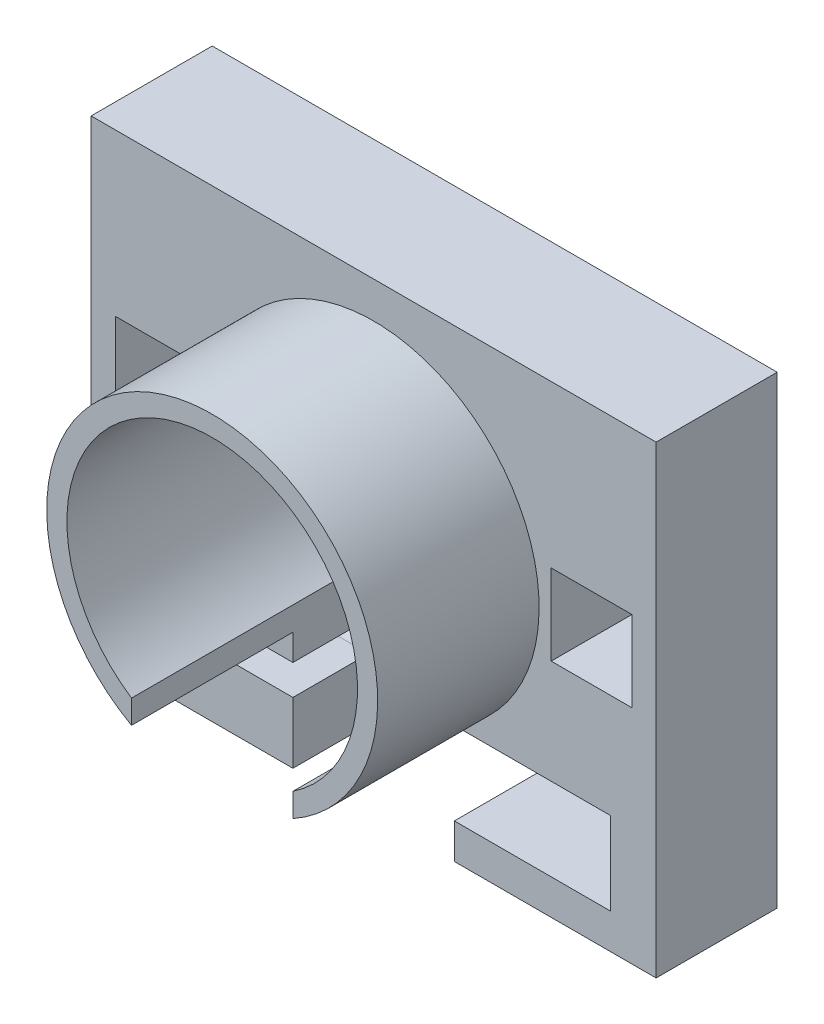
ISO-10303-21;
HEADER;
FILE_DESCRIPTION(('STEP AP214'),'2;1');
FILE_NAME('part.step','',(''),(''),'','','');
FILE_SCHEMA(('AUTOMOTIVE_DESIGN { 1 0 10303 214 1 1 1 1 }'));
ENDSEC;
DATA;
#1=APPLICATION_CONTEXT('core data for automotive mechanical design processes');
#2=APPLICATION_PROTOCOL_DEFINITION('international standard','automotive_design',2000,#1);
#3=PRODUCT_CONTEXT('',#1,'mechanical');
#4=PRODUCT('Part','Part','',(#3));
#5=PRODUCT_RELATED_PRODUCT_CATEGORY('part','',(#4));
#6=PRODUCT_DEFINITION_FORMATION('','',#4);
#7=PRODUCT_DEFINITION_CONTEXT('part definition',#1,'design');
#8=PRODUCT_DEFINITION('design','',#6,#7);
#9=PRODUCT_DEFINITION_SHAPE('','',#8);
#10=(LENGTH_UNIT() NAMED_UNIT(*) SI_UNIT(.MILLI.,.METRE.));
#11=(NAMED_UNIT(*) PLANE_ANGLE_UNIT() SI_UNIT($,.RADIAN.));
#12=(NAMED_UNIT(*) SI_UNIT($,.STERADIAN.) SOLID_ANGLE_UNIT());
#13=UNCERTAINTY_MEASURE_WITH_UNIT(LENGTH_MEASURE(1.E-05),#10,'distance_accuracy_value','');
#14=(GEOMETRIC_REPRESENTATION_CONTEXT(3) GLOBAL_UNCERTAINTY_ASSIGNED_CONTEXT((#13)) GLOBAL_UNIT_ASSIGNED_CONTEXT((#10,
#11,#12)) REPRESENTATION_CONTEXT('',''));
#15=CARTESIAN_POINT('',(0.,0.,0.));
#16=DIRECTION('',(0.,0.,1.));
#17=DIRECTION('',(1.,0.,0.));
#18=AXIS2_PLACEMENT_3D('',#15,#16,#17);
#19=CARTESIAN_POINT('',(38.2114604604619,-28.8452119608953,0.));
#20=DIRECTION('',(1.,0.,0.));
#21=DIRECTION('',(0.,0.,-1.));
#22=AXIS2_PLACEMENT_3D('',#19,#20,#21);
#23=PLANE('',#22);
#24=DIRECTION('',(0.,-1.,0.));
#25=VECTOR('',#24,1.);
#26=CARTESIAN_POINT('',(38.2114604604619,-28.8452119608953,9.));
#27=LINE('',#26,#25);
#28=CARTESIAN_POINT('',(38.2114604604619,-28.8452119608953,9.));
#29=VERTEX_POINT('',#28);
#30=CARTESIAN_POINT('',(38.2114604604619,-49.3452119608953,9.));
#31=VERTEX_POINT('',#30);
#32=EDGE_CURVE('E308',#29,#31,#27,.T.);
#33=ORIENTED_EDGE('',*,*,#32,.F.);
#34=DIRECTION('',(0.,0.,1.));
#35=VECTOR('',#34,1.);
#36=CARTESIAN_POINT('',(38.2114604604619,-28.8452119608953,0.));
#37=LINE('',#36,#35);
#38=CARTESIAN_POINT('',(38.2114604604619,-28.8452119608953,0.));
#39=VERTEX_POINT('',#38);
#40=EDGE_CURVE('E344',#39,#29,#37,.T.);
#41=ORIENTED_EDGE('',*,*,#40,.F.);
#42=DIRECTION('',(0.,1.,0.));
#43=VECTOR('',#42,1.);
#44=CARTESIAN_POINT('',(38.2114604604619,-28.8452119608953,0.));
#45=LINE('',#44,#43);
#46=CARTESIAN_POINT('',(38.2114604604619,-49.3452119608953,0.));
#47=VERTEX_POINT('',#46);
#48=EDGE_CURVE('E330',#47,#39,#45,.T.);
#49=ORIENTED_EDGE('',*,*,#48,.F.);
#50=DIRECTION('',(0.,0.,1.));
#51=VECTOR('',#50,1.);
#52=CARTESIAN_POINT('',(38.2114604604619,-49.3452119608953,0.));
#53=LINE('',#52,#51);
#54=EDGE_CURVE('E347',#47,#31,#53,.T.);
#55=ORIENTED_EDGE('',*,*,#54,.T.);
#56=EDGE_LOOP('',(#33,#41,#49,#55));
#57=FACE_BOUND('',#56,.T.);
#58=ADVANCED_FACE('F51',(#57),#23,.F.);
#59=CARTESIAN_POINT('',(28.5614604604618,56.9468483754513,80.));
#60=DIRECTION('',(1.,0.,0.));
#61=DIRECTION('',(0.,0.,-1.));
#62=AXIS2_PLACEMENT_3D('',#59,#60,#61);
#63=PLANE('',#62);
#64=DIRECTION('',(0.,-1.,0.));
#65=VECTOR('',#64,1.);
#66=CARTESIAN_POINT('',(28.5614604604618,56.9468483754513,0.));
#67=LINE('',#66,#65);
#68=CARTESIAN_POINT('',(28.5614604604618,-27.6951677759263,0.));
#69=VERTEX_POINT('',#68);
#70=CARTESIAN_POINT('',(28.5614604604619,-28.8452119608953,0.));
#71=VERTEX_POINT('',#70);
#72=EDGE_CURVE('E407',#69,#71,#67,.T.);
#73=ORIENTED_EDGE('',*,*,#72,.T.);
#74=DIRECTION('',(0.,0.,1.));
#75=VECTOR('',#74,1.);
#76=CARTESIAN_POINT('',(28.5614604604619,-28.8452119608953,0.));
#77=LINE('',#76,#75);
#78=CARTESIAN_POINT('',(28.5614604604619,-28.8452119608953,30.));
#79=VERTEX_POINT('',#78);
#80=EDGE_CURVE('E340',#71,#79,#77,.T.);
#81=ORIENTED_EDGE('',*,*,#80,.T.);
#82=DIRECTION('',(0.,0.,-1.));
#83=VECTOR('',#82,1.);
#84=CARTESIAN_POINT('',(28.5614604604618,-28.8452119608953,70.));
#85=LINE('',#84,#83);
#86=CARTESIAN_POINT('',(28.5614604604618,-28.8452119608953,70.));
#87=VERTEX_POINT('',#86);
#88=EDGE_CURVE('E410',#79,#87,#85,.F.);
#89=ORIENTED_EDGE('',*,*,#88,.T.);
#90=DIRECTION('',(0.,-1.,0.));
#91=VECTOR('',#90,1.);
#92=CARTESIAN_POINT('',(28.5614604604618,56.9468483754513,70.));
#93=LINE('',#92,#91);
#94=CARTESIAN_POINT('',(28.5614604604618,-22.9874107187402,70.));
#95=VERTEX_POINT('',#94);
#96=EDGE_CURVE('E414',#95,#87,#93,.T.);
#97=ORIENTED_EDGE('',*,*,#96,.F.);
#98=DIRECTION('',(0.,0.,-1.));
#99=VECTOR('',#98,1.);
#100=CARTESIAN_POINT('',(28.5614604604618,-22.9874107187402,30.));
#101=LINE('',#100,#99);
#102=CARTESIAN_POINT('',(28.5614604604618,-22.9874107187402,10.));
#103=VERTEX_POINT('',#102);
#104=EDGE_CURVE('E417',#103,#95,#101,.F.);
#105=ORIENTED_EDGE('',*,*,#104,.F.);
#106=DIRECTION('',(0.,1.,0.));
#107=VECTOR('',#106,1.);
#108=CARTESIAN_POINT('',(28.5614604604618,56.9468483754513,9.99999999999999));
#109=LINE('',#108,#107);
#110=CARTESIAN_POINT('',(28.5614604604618,-27.6951677759263,10.));
#111=VERTEX_POINT('',#110);
#112=EDGE_CURVE('E418',#111,#103,#109,.T.);
#113=ORIENTED_EDGE('',*,*,#112,.F.);
#114=DIRECTION('',(0.,0.,-1.));
#115=VECTOR('',#114,1.);
#116=CARTESIAN_POINT('',(28.5614604604618,-27.6951677759263,10.));
#117=LINE('',#116,#115);
#118=EDGE_CURVE('E385',#111,#69,#117,.T.);
#119=ORIENTED_EDGE('',*,*,#118,.T.);
#120=EDGE_LOOP('',(#73,#81,#89,#97,#105,#113,#119));
#121=FACE_BOUND('',#120,.T.);
#122=ADVANCED_FACE('F575',(#121),#63,.F.);
#123=CARTESIAN_POINT('',(0.,0.,30.));
#124=DIRECTION('',(0.,0.,1.));
#125=DIRECTION('',(1.,0.,0.));
#126=AXIS2_PLACEMENT_3D('',#123,#124,#125);
#127=PLANE('',#126);
#128=DIRECTION('',(-1.,0.,0.));
#129=VECTOR('',#128,1.);
#130=CARTESIAN_POINT('',(28.5614604604619,-28.8452119608953,30.));
#131=LINE('',#130,#129);
#132=CARTESIAN_POINT('',(67.2114604604618,-28.8452119608953,30.));
#133=VERTEX_POINT('',#132);
#134=EDGE_CURVE('E331',#133,#79,#131,.T.);
#135=ORIENTED_EDGE('',*,*,#134,.F.);
#136=DIRECTION('',(0.,1.,0.));
#137=VECTOR('',#136,1.);
#138=CARTESIAN_POINT('',(67.2114604604618,-28.8452119608953,30.));
#139=LINE('',#138,#137);
#140=CARTESIAN_POINT('',(67.2114604604618,-49.3452119608953,30.));
#141=VERTEX_POINT('',#140);
#142=EDGE_CURVE('E307',#141,#133,#139,.T.);
#143=ORIENTED_EDGE('',*,*,#142,.F.);
#144=DIRECTION('',(1.,0.,0.));
#145=VECTOR('',#144,1.);
#146=CARTESIAN_POINT('',(28.5614604604619,-49.3452119608953,30.));
#147=LINE('',#146,#145);
#148=CARTESIAN_POINT('',(28.5614604604619,-49.3452119608953,30.));
#149=VERTEX_POINT('',#148);
#150=EDGE_CURVE('E324',#149,#141,#147,.T.);
#151=ORIENTED_EDGE('',*,*,#150,.F.);
#152=DIRECTION('',(0.,-1.,0.));
#153=VECTOR('',#152,1.);
#154=CARTESIAN_POINT('',(28.5614604604618,56.9468483754513,30.));
#155=LINE('',#154,#153);
#156=CARTESIAN_POINT('',(28.5614604604618,-58.0541516245487,30.));
#157=VERTEX_POINT('',#156);
#158=EDGE_CURVE('E369',#149,#157,#155,.T.);
#159=ORIENTED_EDGE('',*,*,#158,.T.);
#160=DIRECTION('',(1.,0.,0.));
#161=VECTOR('',#160,1.);
#162=CARTESIAN_POINT('',(-61.4385395395382,-58.0541516245487,30.));
#163=LINE('',#162,#161);
#164=CARTESIAN_POINT('',(78.5614604604618,-58.0541516245487,30.));
#165=VERTEX_POINT('',#164);
#166=EDGE_CURVE('E505',#157,#165,#163,.T.);
#167=ORIENTED_EDGE('',*,*,#166,.T.);
#168=DIRECTION('',(0.,1.,0.));
#169=VECTOR('',#168,1.);
#170=CARTESIAN_POINT('',(78.5614604604618,56.9458483754513,30.));
#171=LINE('',#170,#169);
#172=CARTESIAN_POINT('',(78.5614604604618,56.9458483754513,30.));
#173=VERTEX_POINT('',#172);
#174=EDGE_CURVE('E510',#165,#173,#171,.T.);
#175=ORIENTED_EDGE('',*,*,#174,.T.);
#176=DIRECTION('',(-1.,0.,0.));
#177=VECTOR('',#176,1.);
#178=CARTESIAN_POINT('',(-61.4385395395382,56.9458483754513,30.));
#179=LINE('',#178,#177);
#180=CARTESIAN_POINT('',(-61.4385395395382,56.9458483754513,30.));
#181=VERTEX_POINT('',#180);
#182=EDGE_CURVE('E512',#173,#181,#179,.T.);
#183=ORIENTED_EDGE('',*,*,#182,.T.);
#184=DIRECTION('',(0.,-1.,0.));
#185=VECTOR('',#184,1.);
#186=CARTESIAN_POINT('',(-61.4385395395382,56.9458483754513,30.));
#187=LINE('',#186,#185);
#188=CARTESIAN_POINT('',(-61.4385395395382,-58.0541516245487,30.));
#189=VERTEX_POINT('',#188);
#190=EDGE_CURVE('E502',#181,#189,#187,.T.);
#191=ORIENTED_EDGE('',*,*,#190,.T.);
#192=CARTESIAN_POINT('',(-11.4385395395382,-58.0541516245487,30.));
#193=VERTEX_POINT('',#192);
#194=EDGE_CURVE('E507',#189,#193,#163,.T.);
#195=ORIENTED_EDGE('',*,*,#194,.T.);
#196=DIRECTION('',(0.,1.,0.));
#197=VECTOR('',#196,1.);
#198=CARTESIAN_POINT('',(-11.4385395395382,56.9468483754513,30.));
#199=LINE('',#198,#197);
#200=CARTESIAN_POINT('',(-11.4385395395382,-42.8452119608953,30.));
#201=VERTEX_POINT('',#200);
#202=EDGE_CURVE('E382',#193,#201,#199,.T.);
#203=ORIENTED_EDGE('',*,*,#202,.T.);
#204=DIRECTION('',(1.,0.,0.));
#205=VECTOR('',#204,1.);
#206=CARTESIAN_POINT('',(-26.4385395395382,-42.8452119608953,30.));
#207=LINE('',#206,#205);
#208=CARTESIAN_POINT('',(-26.4385395395382,-42.8452119608953,30.));
#209=VERTEX_POINT('',#208);
#210=EDGE_CURVE('E370',#209,#201,#207,.T.);
#211=ORIENTED_EDGE('',*,*,#210,.F.);
#212=DIRECTION('',(0.,-1.,0.));
#213=VECTOR('',#212,1.);
#214=CARTESIAN_POINT('',(-26.4385395395382,0.,30.));
#215=LINE('',#214,#213);
#216=CARTESIAN_POINT('',(-26.4385395395382,-35.3452119608953,30.));
#217=VERTEX_POINT('',#216);
#218=EDGE_CURVE('E354',#217,#209,#215,.T.);
#219=ORIENTED_EDGE('',*,*,#218,.F.);
#220=DIRECTION('',(1.,0.,0.));
#221=VECTOR('',#220,1.);
#222=CARTESIAN_POINT('',(-26.4385395395382,-35.3452119608953,30.));
#223=LINE('',#222,#221);
#224=CARTESIAN_POINT('',(-11.4385395395382,-35.3452119608953,30.));
#225=VERTEX_POINT('',#224);
#226=EDGE_CURVE('E372',#217,#225,#223,.T.);
#227=ORIENTED_EDGE('',*,*,#226,.T.);
#228=CARTESIAN_POINT('',(-11.4385395395382,-28.8452119608953,30.));
#229=VERTEX_POINT('',#228);
#230=EDGE_CURVE('E381',#225,#229,#199,.T.);
#231=ORIENTED_EDGE('',*,*,#230,.T.);
#232=CARTESIAN_POINT('',(8.56146046046181,6.94584837545127,30.));
#233=DIRECTION('',(0.,0.,1.));
#234=DIRECTION('',(1.,0.,0.));
#235=AXIS2_PLACEMENT_3D('',#232,#233,#234);
#236=CIRCLE('',#235,41.);
#237=EDGE_CURVE('E427',#79,#229,#236,.T.);
#238=ORIENTED_EDGE('',*,*,#237,.F.);
#239=EDGE_LOOP('',(#135,#143,#151,#159,#167,#175,#183,#191,#195,#203,#211,#219,#227,#231,#238));
#240=FACE_BOUND('',#239,.T.);
#241=DIRECTION('',(1.,0.,0.));
#242=VECTOR('',#241,1.);
#243=CARTESIAN_POINT('',(-55.4385395395382,-3.05415162454873,30.));
#244=LINE('',#243,#242);
#245=CARTESIAN_POINT('',(-55.4385395395382,-3.05415162454873,30.));
#246=VERTEX_POINT('',#245);
#247=CARTESIAN_POINT('',(-35.4385395395382,-3.05415162454873,30.));
#248=VERTEX_POINT('',#247);
#249=EDGE_CURVE('E473',#246,#248,#244,.T.);
#250=ORIENTED_EDGE('',*,*,#249,.F.);
#251=DIRECTION('',(0.,-1.,0.));
#252=VECTOR('',#251,1.);
#253=CARTESIAN_POINT('',(-55.4385395395382,16.9458483754513,30.));
#254=LINE('',#253,#252);
#255=CARTESIAN_POINT('',(-55.4385395395382,16.9458483754513,30.));
#256=VERTEX_POINT('',#255);
#257=EDGE_CURVE('E471',#256,#246,#254,.T.);
#258=ORIENTED_EDGE('',*,*,#257,.F.);
#259=DIRECTION('',(-1.,0.,0.));
#260=VECTOR('',#259,1.);
#261=CARTESIAN_POINT('',(-55.4385395395382,16.9458483754513,30.));
#262=LINE('',#261,#260);
#263=CARTESIAN_POINT('',(-35.4385395395382,16.9458483754513,30.));
#264=VERTEX_POINT('',#263);
#265=EDGE_CURVE('E479',#264,#256,#262,.T.);
#266=ORIENTED_EDGE('',*,*,#265,.F.);
#267=DIRECTION('',(0.,1.,0.));
#268=VECTOR('',#267,1.);
#269=CARTESIAN_POINT('',(-35.4385395395382,16.9458483754513,30.));
#270=LINE('',#269,#268);
#271=EDGE_CURVE('E476',#248,#264,#270,.T.);
#272=ORIENTED_EDGE('',*,*,#271,.F.);
#273=EDGE_LOOP('',(#250,#258,#266,#272));
#274=FACE_BOUND('',#273,.T.);
#275=DIRECTION('',(1.,0.,0.));
#276=VECTOR('',#275,1.);
#277=CARTESIAN_POINT('',(52.5614604604618,-3.05415162454873,30.));
#278=LINE('',#277,#276);
#279=CARTESIAN_POINT('',(52.5614604604618,-3.05415162454873,30.));
#280=VERTEX_POINT('',#279);
#281=CARTESIAN_POINT('',(72.5614604604618,-3.05415162454873,30.));
#282=VERTEX_POINT('',#281);
#283=EDGE_CURVE('E441',#280,#282,#278,.T.);
#284=ORIENTED_EDGE('',*,*,#283,.F.);
#285=DIRECTION('',(0.,-1.,0.));
#286=VECTOR('',#285,1.);
#287=CARTESIAN_POINT('',(52.5614604604618,16.9458483754513,30.));
#288=LINE('',#287,#286);
#289=CARTESIAN_POINT('',(52.5614604604618,16.9458483754513,30.));
#290=VERTEX_POINT('',#289);
#291=EDGE_CURVE('E439',#290,#280,#288,.T.);
#292=ORIENTED_EDGE('',*,*,#291,.F.);
#293=DIRECTION('',(-1.,0.,0.));
#294=VECTOR('',#293,1.);
#295=CARTESIAN_POINT('',(52.5614604604618,16.9458483754513,30.));
#296=LINE('',#295,#294);
#297=CARTESIAN_POINT('',(72.5614604604618,16.9458483754513,30.));
#298=VERTEX_POINT('',#297);
#299=EDGE_CURVE('E447',#298,#290,#296,.T.);
#300=ORIENTED_EDGE('',*,*,#299,.F.);
#301=DIRECTION('',(0.,1.,0.));
#302=VECTOR('',#301,1.);
#303=CARTESIAN_POINT('',(72.5614604604618,16.9458483754513,30.));
#304=LINE('',#303,#302);
#305=EDGE_CURVE('E444',#282,#298,#304,.T.);
#306=ORIENTED_EDGE('',*,*,#305,.F.);
#307=EDGE_LOOP('',(#284,#292,#300,#306));
#308=FACE_BOUND('',#307,.T.);
#309=ADVANCED_FACE('F553',(#240,#274,#308),#127,.T.);
#310=CARTESIAN_POINT('',(-11.4385395395382,56.9468483754513,80.));
#311=DIRECTION('',(-1.,0.,0.));
#312=DIRECTION('',(0.,0.,1.));
#313=AXIS2_PLACEMENT_3D('',#310,#311,#312);
#314=PLANE('',#313);
#315=DIRECTION('',(0.,0.,1.));
#316=VECTOR('',#315,1.);
#317=CARTESIAN_POINT('',(-11.4385395395381,-42.8452119608953,0.));
#318=LINE('',#317,#316);
#319=CARTESIAN_POINT('',(-11.4385395395382,-42.8452119608953,11.25));
#320=VERTEX_POINT('',#319);
#321=EDGE_CURVE('E355',#320,#201,#318,.T.);
#322=ORIENTED_EDGE('',*,*,#321,.T.);
#323=ORIENTED_EDGE('',*,*,#202,.F.);
#324=DIRECTION('',(0.,0.,-1.));
#325=VECTOR('',#324,1.);
#326=CARTESIAN_POINT('',(-11.4385395395382,-58.0541516245487,80.));
#327=LINE('',#326,#325);
#328=CARTESIAN_POINT('',(-11.4385395395381,-58.0541516245487,0.));
#329=VERTEX_POINT('',#328);
#330=EDGE_CURVE('E401',#193,#329,#327,.T.);
#331=ORIENTED_EDGE('',*,*,#330,.T.);
#332=DIRECTION('',(0.,-1.,0.));
#333=VECTOR('',#332,1.);
#334=CARTESIAN_POINT('',(-11.4385395395381,56.9468483754513,0.));
#335=LINE('',#334,#333);
#336=CARTESIAN_POINT('',(-11.4385395395381,-27.6951677759263,0.));
#337=VERTEX_POINT('',#336);
#338=EDGE_CURVE('E406',#337,#329,#335,.T.);
#339=ORIENTED_EDGE('',*,*,#338,.F.);
#340=DIRECTION('',(0.,0.,-1.));
#341=VECTOR('',#340,1.);
#342=CARTESIAN_POINT('',(-11.4385395395382,-27.6951677759263,9.99999999999999));
#343=LINE('',#342,#341);
#344=CARTESIAN_POINT('',(-11.4385395395381,-27.6951677759263,10.));
#345=VERTEX_POINT('',#344);
#346=EDGE_CURVE('E387',#337,#345,#343,.F.);
#347=ORIENTED_EDGE('',*,*,#346,.T.);
#348=DIRECTION('',(0.,-1.,0.));
#349=VECTOR('',#348,1.);
#350=CARTESIAN_POINT('',(-11.4385395395381,56.9468483754513,9.99999999999999));
#351=LINE('',#350,#349);
#352=CARTESIAN_POINT('',(-11.4385395395381,-22.9874107187403,10.));
#353=VERTEX_POINT('',#352);
#354=EDGE_CURVE('E395',#353,#345,#351,.T.);
#355=ORIENTED_EDGE('',*,*,#354,.F.);
#356=DIRECTION('',(0.,0.,-1.));
#357=VECTOR('',#356,1.);
#358=CARTESIAN_POINT('',(-11.4385395395382,-22.9874107187403,30.));
#359=LINE('',#358,#357);
#360=CARTESIAN_POINT('',(-11.4385395395382,-22.9874107187403,70.));
#361=VERTEX_POINT('',#360);
#362=EDGE_CURVE('E398',#361,#353,#359,.T.);
#363=ORIENTED_EDGE('',*,*,#362,.F.);
#364=DIRECTION('',(0.,1.,0.));
#365=VECTOR('',#364,1.);
#366=CARTESIAN_POINT('',(-11.4385395395382,56.9468483754513,70.));
#367=LINE('',#366,#365);
#368=CARTESIAN_POINT('',(-11.4385395395382,-28.8452119608953,70.));
#369=VERTEX_POINT('',#368);
#370=EDGE_CURVE('E392',#369,#361,#367,.T.);
#371=ORIENTED_EDGE('',*,*,#370,.F.);
#372=DIRECTION('',(0.,0.,-1.));
#373=VECTOR('',#372,1.);
#374=CARTESIAN_POINT('',(-11.4385395395382,-28.8452119608953,70.));
#375=LINE('',#374,#373);
#376=EDGE_CURVE('E389',#369,#229,#375,.T.);
#377=ORIENTED_EDGE('',*,*,#376,.T.);
#378=ORIENTED_EDGE('',*,*,#230,.F.);
#379=DIRECTION('',(0.,0.,1.));
#380=VECTOR('',#379,1.);
#381=CARTESIAN_POINT('',(-11.4385395395381,-35.3452119608953,0.));
#382=LINE('',#381,#380);
#383=CARTESIAN_POINT('',(-11.4385395395381,-35.3452119608953,11.25));
#384=VERTEX_POINT('',#383);
#385=EDGE_CURVE('E361',#384,#225,#382,.T.);
#386=ORIENTED_EDGE('',*,*,#385,.F.);
#387=CARTESIAN_POINT('',(-11.4385395395381,-39.0952119608953,11.25));
#388=DIRECTION('',(1.,0.,0.));
#389=DIRECTION('',(0.,0.,-1.));
#390=AXIS2_PLACEMENT_3D('',#387,#388,#389);
#391=CIRCLE('',#390,3.75);
#392=EDGE_CURVE('E343',#320,#384,#391,.T.);
#393=ORIENTED_EDGE('',*,*,#392,.F.);
#394=EDGE_LOOP('',(#322,#323,#331,#339,#347,#355,#363,#371,#377,#378,#386,#393));
#395=FACE_BOUND('',#394,.T.);
#396=ADVANCED_FACE('F587',(#395),#314,.F.);
#397=CARTESIAN_POINT('',(-61.4385395395382,-58.0541516245487,30.));
#398=DIRECTION('',(0.,1.,0.));
#399=DIRECTION('',(0.,0.,1.));
#400=AXIS2_PLACEMENT_3D('',#397,#398,#399);
#401=PLANE('',#400);
#402=ORIENTED_EDGE('',*,*,#166,.F.);
#403=DIRECTION('',(0.,0.,1.));
#404=VECTOR('',#403,1.);
#405=CARTESIAN_POINT('',(28.5614604604618,-58.0541516245487,80.));
#406=LINE('',#405,#404);
#407=CARTESIAN_POINT('',(28.5614604604618,-58.0541516245487,0.));
#408=VERTEX_POINT('',#407);
#409=EDGE_CURVE('E403',#408,#157,#406,.T.);
#410=ORIENTED_EDGE('',*,*,#409,.F.);
#411=DIRECTION('',(1.,0.,0.));
#412=VECTOR('',#411,1.);
#413=CARTESIAN_POINT('',(-61.4385395395382,-58.0541516245487,0.));
#414=LINE('',#413,#412);
#415=CARTESIAN_POINT('',(78.5614604604618,-58.0541516245487,0.));
#416=VERTEX_POINT('',#415);
#417=EDGE_CURVE('E517',#408,#416,#414,.T.);
#418=ORIENTED_EDGE('',*,*,#417,.T.);
#419=DIRECTION('',(0.,0.,-1.));
#420=VECTOR('',#419,1.);
#421=CARTESIAN_POINT('',(78.5614604604618,-58.0541516245487,30.));
#422=LINE('',#421,#420);
#423=EDGE_CURVE('E60',#165,#416,#422,.T.);
#424=ORIENTED_EDGE('',*,*,#423,.F.);
#425=EDGE_LOOP('',(#402,#410,#418,#424));
#426=FACE_BOUND('',#425,.T.);
#427=ADVANCED_FACE('F558',(#426),#401,.F.);
#428=CARTESIAN_POINT('',(8.56146046046181,6.94584837545127,30.));
#429=DIRECTION('',(0.,0.,-1.));
#430=DIRECTION('',(-1.,0.,0.));
#431=AXIS2_PLACEMENT_3D('',#428,#429,#430);
#432=CYLINDRICAL_SURFACE('',#431,36.);
#433=ORIENTED_EDGE('',*,*,#104,.T.);
#434=CARTESIAN_POINT('',(8.56146046046181,6.94584837545127,70.));
#435=DIRECTION('',(0.,0.,1.));
#436=DIRECTION('',(1.,0.,0.));
#437=AXIS2_PLACEMENT_3D('',#434,#435,#436);
#438=CIRCLE('',#437,36.);
#439=EDGE_CURVE('E421',#95,#361,#438,.T.);
#440=ORIENTED_EDGE('',*,*,#439,.T.);
#441=ORIENTED_EDGE('',*,*,#362,.T.);
#442=CARTESIAN_POINT('',(8.56146046046181,6.94584837545127,10.));
#443=DIRECTION('',(0.,0.,-1.));
#444=DIRECTION('',(-1.,0.,0.));
#445=AXIS2_PLACEMENT_3D('',#442,#443,#444);
#446=CIRCLE('',#445,36.);
#447=EDGE_CURVE('E55',#353,#103,#446,.T.);
#448=ORIENTED_EDGE('',*,*,#447,.T.);
#449=EDGE_LOOP('',(#433,#440,#441,#448));
#450=FACE_BOUND('',#449,.T.);
#451=ADVANCED_FACE('F589',(#450),#432,.F.);
#452=CARTESIAN_POINT('',(0.,0.,0.));
#453=DIRECTION('',(0.,0.,1.));
#454=DIRECTION('',(1.,0.,0.));
#455=AXIS2_PLACEMENT_3D('',#452,#453,#454);
#456=PLANE('',#455);
#457=DIRECTION('',(-1.,0.,0.));
#458=VECTOR('',#457,1.);
#459=CARTESIAN_POINT('',(0.,-35.0952119608953,0.));
#460=LINE('',#459,#458);
#461=CARTESIAN_POINT('',(64.2114604604618,-35.0952119608953,0.));
#462=VERTEX_POINT('',#461);
#463=CARTESIAN_POINT('',(57.2114604604618,-35.0952119608953,0.));
#464=VERTEX_POINT('',#463);
#465=EDGE_CURVE('E301',#462,#464,#460,.T.);
#466=ORIENTED_EDGE('',*,*,#465,.T.);
#467=DIRECTION('',(0.,-1.,0.));
#468=VECTOR('',#467,1.);
#469=CARTESIAN_POINT('',(57.2114604604618,0.,0.));
#470=LINE('',#469,#468);
#471=CARTESIAN_POINT('',(57.2114604604618,-43.0952119608953,0.));
#472=VERTEX_POINT('',#471);
#473=EDGE_CURVE('E304',#464,#472,#470,.T.);
#474=ORIENTED_EDGE('',*,*,#473,.T.);
#475=DIRECTION('',(1.,0.,0.));
#476=VECTOR('',#475,1.);
#477=CARTESIAN_POINT('',(0.,-43.0952119608953,0.));
#478=LINE('',#477,#476);
#479=CARTESIAN_POINT('',(64.2114604604618,-43.0952119608953,0.));
#480=VERTEX_POINT('',#479);
#481=EDGE_CURVE('E296',#472,#480,#478,.T.);
#482=ORIENTED_EDGE('',*,*,#481,.T.);
#483=DIRECTION('',(0.,1.,0.));
#484=VECTOR('',#483,1.);
#485=CARTESIAN_POINT('',(64.2114604604618,0.,0.));
#486=LINE('',#485,#484);
#487=EDGE_CURVE('E276',#480,#462,#486,.T.);
#488=ORIENTED_EDGE('',*,*,#487,.T.);
#489=EDGE_LOOP('',(#466,#474,#482,#488));
#490=FACE_BOUND('',#489,.T.);
#491=ORIENTED_EDGE('',*,*,#48,.T.);
#492=DIRECTION('',(-1.,0.,0.));
#493=VECTOR('',#492,1.);
#494=CARTESIAN_POINT('',(28.5614604604619,-28.8452119608953,0.));
#495=LINE('',#494,#493);
#496=EDGE_CURVE('E334',#39,#71,#495,.T.);
#497=ORIENTED_EDGE('',*,*,#496,.T.);
#498=ORIENTED_EDGE('',*,*,#72,.F.);
#499=CARTESIAN_POINT('',(8.56146046046181,6.94584837545127,0.));
#500=DIRECTION('',(0.,0.,-1.));
#501=DIRECTION('',(-1.,0.,0.));
#502=AXIS2_PLACEMENT_3D('',#499,#500,#501);
#503=CIRCLE('',#502,40.);
#504=EDGE_CURVE('E431',#337,#69,#503,.T.);
#505=ORIENTED_EDGE('',*,*,#504,.F.);
#506=ORIENTED_EDGE('',*,*,#338,.T.);
#507=CARTESIAN_POINT('',(-61.4385395395382,-58.0541516245487,0.));
#508=VERTEX_POINT('',#507);
#509=EDGE_CURVE('E518',#508,#329,#414,.T.);
#510=ORIENTED_EDGE('',*,*,#509,.F.);
#511=DIRECTION('',(0.,-1.,0.));
#512=VECTOR('',#511,1.);
#513=CARTESIAN_POINT('',(-61.4385395395382,56.9458483754513,0.));
#514=LINE('',#513,#512);
#515=CARTESIAN_POINT('',(-61.4385395395382,56.9458483754513,0.));
#516=VERTEX_POINT('',#515);
#517=EDGE_CURVE('E501',#516,#508,#514,.T.);
#518=ORIENTED_EDGE('',*,*,#517,.F.);
#519=DIRECTION('',(-1.,0.,0.));
#520=VECTOR('',#519,1.);
#521=CARTESIAN_POINT('',(-61.4385395395382,56.9458483754513,0.));
#522=LINE('',#521,#520);
#523=CARTESIAN_POINT('',(78.5614604604618,56.9458483754513,0.));
#524=VERTEX_POINT('',#523);
#525=EDGE_CURVE('E506',#524,#516,#522,.T.);
#526=ORIENTED_EDGE('',*,*,#525,.F.);
#527=DIRECTION('',(0.,1.,0.));
#528=VECTOR('',#527,1.);
#529=CARTESIAN_POINT('',(78.5614604604618,56.9458483754513,0.));
#530=LINE('',#529,#528);
#531=EDGE_CURVE('E521',#416,#524,#530,.T.);
#532=ORIENTED_EDGE('',*,*,#531,.F.);
#533=ORIENTED_EDGE('',*,*,#417,.F.);
#534=CARTESIAN_POINT('',(28.5614604604618,-49.3452119608953,0.));
#535=VERTEX_POINT('',#534);
#536=EDGE_CURVE('E411',#535,#408,#67,.T.);
#537=ORIENTED_EDGE('',*,*,#536,.F.);
#538=DIRECTION('',(1.,0.,0.));
#539=VECTOR('',#538,1.);
#540=CARTESIAN_POINT('',(28.5614604604619,-49.3452119608953,0.));
#541=LINE('',#540,#539);
#542=EDGE_CURVE('E327',#535,#47,#541,.T.);
#543=ORIENTED_EDGE('',*,*,#542,.T.);
#544=EDGE_LOOP('',(#491,#497,#498,#505,#506,#510,#518,#526,#532,#533,#537,#543));
#545=FACE_BOUND('',#544,.T.);
#546=DIRECTION('',(0.,-1.,0.));
#547=VECTOR('',#546,1.);
#548=CARTESIAN_POINT('',(-55.4385395395382,16.9458483754513,0.));
#549=LINE('',#548,#547);
#550=CARTESIAN_POINT('',(-55.4385395395382,16.9458483754513,0.));
#551=VERTEX_POINT('',#550);
#552=CARTESIAN_POINT('',(-55.4385395395382,-3.05415162454873,0.));
#553=VERTEX_POINT('',#552);
#554=EDGE_CURVE('E470',#551,#553,#549,.T.);
#555=ORIENTED_EDGE('',*,*,#554,.T.);
#556=DIRECTION('',(1.,0.,0.));
#557=VECTOR('',#556,1.);
#558=CARTESIAN_POINT('',(-55.4385395395382,-3.05415162454873,0.));
#559=LINE('',#558,#557);
#560=CARTESIAN_POINT('',(-35.4385395395382,-3.05415162454873,0.));
#561=VERTEX_POINT('',#560);
#562=EDGE_CURVE('E484',#553,#561,#559,.T.);
#563=ORIENTED_EDGE('',*,*,#562,.T.);
#564=DIRECTION('',(0.,1.,0.));
#565=VECTOR('',#564,1.);
#566=CARTESIAN_POINT('',(-35.4385395395382,16.9458483754513,0.));
#567=LINE('',#566,#565);
#568=CARTESIAN_POINT('',(-35.4385395395382,16.9458483754513,0.));
#569=VERTEX_POINT('',#568);
#570=EDGE_CURVE('E487',#561,#569,#567,.T.);
#571=ORIENTED_EDGE('',*,*,#570,.T.);
#572=DIRECTION('',(-1.,0.,0.));
#573=VECTOR('',#572,1.);
#574=CARTESIAN_POINT('',(-55.4385395395382,16.9458483754513,0.));
#575=LINE('',#574,#573);
#576=EDGE_CURVE('E474',#569,#551,#575,.T.);
#577=ORIENTED_EDGE('',*,*,#576,.T.);
#578=EDGE_LOOP('',(#555,#563,#571,#577));
#579=FACE_BOUND('',#578,.T.);
#580=DIRECTION('',(0.,-1.,0.));
#581=VECTOR('',#580,1.);
#582=CARTESIAN_POINT('',(52.5614604604618,16.9458483754513,0.));
#583=LINE('',#582,#581);
#584=CARTESIAN_POINT('',(52.5614604604618,16.9458483754513,0.));
#585=VERTEX_POINT('',#584);
#586=CARTESIAN_POINT('',(52.5614604604618,-3.05415162454873,0.));
#587=VERTEX_POINT('',#586);
#588=EDGE_CURVE('E450',#585,#587,#583,.T.);
#589=ORIENTED_EDGE('',*,*,#588,.T.);
#590=DIRECTION('',(1.,0.,0.));
#591=VECTOR('',#590,1.);
#592=CARTESIAN_POINT('',(52.5614604604618,-3.05415162454873,0.));
#593=LINE('',#592,#591);
#594=CARTESIAN_POINT('',(72.5614604604618,-3.05415162454873,0.));
#595=VERTEX_POINT('',#594);
#596=EDGE_CURVE('E453',#587,#595,#593,.T.);
#597=ORIENTED_EDGE('',*,*,#596,.T.);
#598=DIRECTION('',(0.,1.,0.));
#599=VECTOR('',#598,1.);
#600=CARTESIAN_POINT('',(72.5614604604618,16.9458483754513,0.));
#601=LINE('',#600,#599);
#602=CARTESIAN_POINT('',(72.5614604604618,16.9458483754513,0.));
#603=VERTEX_POINT('',#602);
#604=EDGE_CURVE('E456',#595,#603,#601,.T.);
#605=ORIENTED_EDGE('',*,*,#604,.T.);
#606=DIRECTION('',(-1.,0.,0.));
#607=VECTOR('',#606,1.);
#608=CARTESIAN_POINT('',(52.5614604604618,16.9458483754513,0.));
#609=LINE('',#608,#607);
#610=EDGE_CURVE('E442',#603,#585,#609,.T.);
#611=ORIENTED_EDGE('',*,*,#610,.T.);
#612=EDGE_LOOP('',(#589,#597,#605,#611));
#613=FACE_BOUND('',#612,.T.);
#614=ADVANCED_FACE('F541',(#490,#545,#579,#613),#456,.F.);
#615=CARTESIAN_POINT('',(-61.4385395395382,56.9458483754513,30.));
#616=DIRECTION('',(1.,0.,0.));
#617=DIRECTION('',(0.,1.,0.));
#618=AXIS2_PLACEMENT_3D('',#615,#616,#617);
#619=PLANE('',#618);
#620=ORIENTED_EDGE('',*,*,#517,.T.);
#621=DIRECTION('',(0.,0.,-1.));
#622=VECTOR('',#621,1.);
#623=CARTESIAN_POINT('',(-61.4385395395382,-58.0541516245487,30.));
#624=LINE('',#623,#622);
#625=EDGE_CURVE('E12',#189,#508,#624,.T.);
#626=ORIENTED_EDGE('',*,*,#625,.F.);
#627=ORIENTED_EDGE('',*,*,#190,.F.);
#628=DIRECTION('',(0.,0.,-1.));
#629=VECTOR('',#628,1.);
#630=CARTESIAN_POINT('',(-61.4385395395382,56.9458483754513,30.));
#631=LINE('',#630,#629);
#632=EDGE_CURVE('E514',#181,#516,#631,.T.);
#633=ORIENTED_EDGE('',*,*,#632,.T.);
#634=EDGE_LOOP('',(#620,#626,#627,#633));
#635=FACE_BOUND('',#634,.T.);
#636=ADVANCED_FACE('F53',(#635),#619,.F.);
#637=ORIENTED_EDGE('',*,*,#509,.T.);
#638=ORIENTED_EDGE('',*,*,#330,.F.);
#639=ORIENTED_EDGE('',*,*,#194,.F.);
#640=ORIENTED_EDGE('',*,*,#625,.T.);
#641=EDGE_LOOP('',(#637,#638,#639,#640));
#642=FACE_BOUND('',#641,.T.);
#643=ADVANCED_FACE('F666',(#642),#401,.F.);
#644=CARTESIAN_POINT('',(78.5614604604618,56.9458483754513,30.));
#645=DIRECTION('',(-1.,0.,0.));
#646=DIRECTION('',(0.,-1.,0.));
#647=AXIS2_PLACEMENT_3D('',#644,#645,#646);
#648=PLANE('',#647);
#649=ORIENTED_EDGE('',*,*,#531,.T.);
#650=DIRECTION('',(0.,0.,-1.));
#651=VECTOR('',#650,1.);
#652=CARTESIAN_POINT('',(78.5614604604618,56.9458483754513,30.));
#653=LINE('',#652,#651);
#654=EDGE_CURVE('E526',#173,#524,#653,.T.);
#655=ORIENTED_EDGE('',*,*,#654,.F.);
#656=ORIENTED_EDGE('',*,*,#174,.F.);
#657=ORIENTED_EDGE('',*,*,#423,.T.);
#658=EDGE_LOOP('',(#649,#655,#656,#657));
#659=FACE_BOUND('',#658,.T.);
#660=ADVANCED_FACE('F534',(#659),#648,.F.);
#661=CARTESIAN_POINT('',(-61.4385395395382,56.9458483754513,30.));
#662=DIRECTION('',(0.,-1.,0.));
#663=DIRECTION('',(0.,0.,-1.));
#664=AXIS2_PLACEMENT_3D('',#661,#662,#663);
#665=PLANE('',#664);
#666=ORIENTED_EDGE('',*,*,#525,.T.);
#667=ORIENTED_EDGE('',*,*,#632,.F.);
#668=ORIENTED_EDGE('',*,*,#182,.F.);
#669=ORIENTED_EDGE('',*,*,#654,.T.);
#670=EDGE_LOOP('',(#666,#667,#668,#669));
#671=FACE_BOUND('',#670,.T.);
#672=ADVANCED_FACE('F547',(#671),#665,.F.);
#673=CARTESIAN_POINT('',(-55.4385395395382,16.9458483754513,30.));
#674=DIRECTION('',(1.,0.,0.));
#675=DIRECTION('',(0.,1.,0.));
#676=AXIS2_PLACEMENT_3D('',#673,#674,#675);
#677=PLANE('',#676);
#678=ORIENTED_EDGE('',*,*,#554,.F.);
#679=DIRECTION('',(0.,0.,-1.));
#680=VECTOR('',#679,1.);
#681=CARTESIAN_POINT('',(-55.4385395395382,16.9458483754513,30.));
#682=LINE('',#681,#680);
#683=EDGE_CURVE('E481',#256,#551,#682,.T.);
#684=ORIENTED_EDGE('',*,*,#683,.F.);
#685=ORIENTED_EDGE('',*,*,#257,.T.);
#686=DIRECTION('',(0.,0.,-1.));
#687=VECTOR('',#686,1.);
#688=CARTESIAN_POINT('',(-55.4385395395382,-3.05415162454873,30.));
#689=LINE('',#688,#687);
#690=EDGE_CURVE('E498',#246,#553,#689,.T.);
#691=ORIENTED_EDGE('',*,*,#690,.T.);
#692=EDGE_LOOP('',(#678,#684,#685,#691));
#693=FACE_BOUND('',#692,.T.);
#694=ADVANCED_FACE('F673',(#693),#677,.T.);
#695=CARTESIAN_POINT('',(-55.4385395395382,-3.05415162454873,30.));
#696=DIRECTION('',(0.,1.,0.));
#697=DIRECTION('',(0.,0.,1.));
#698=AXIS2_PLACEMENT_3D('',#695,#696,#697);
#699=PLANE('',#698);
#700=ORIENTED_EDGE('',*,*,#562,.F.);
#701=ORIENTED_EDGE('',*,*,#690,.F.);
#702=ORIENTED_EDGE('',*,*,#249,.T.);
#703=DIRECTION('',(0.,0.,-1.));
#704=VECTOR('',#703,1.);
#705=CARTESIAN_POINT('',(-35.4385395395382,-3.05415162454873,30.));
#706=LINE('',#705,#704);
#707=EDGE_CURVE('E496',#248,#561,#706,.T.);
#708=ORIENTED_EDGE('',*,*,#707,.T.);
#709=EDGE_LOOP('',(#700,#701,#702,#708));
#710=FACE_BOUND('',#709,.T.);
#711=ADVANCED_FACE('F719',(#710),#699,.T.);
#712=CARTESIAN_POINT('',(-35.4385395395382,16.9458483754513,30.));
#713=DIRECTION('',(-1.,0.,0.));
#714=DIRECTION('',(0.,0.,1.));
#715=AXIS2_PLACEMENT_3D('',#712,#713,#714);
#716=PLANE('',#715);
#717=ORIENTED_EDGE('',*,*,#570,.F.);
#718=ORIENTED_EDGE('',*,*,#707,.F.);
#719=ORIENTED_EDGE('',*,*,#271,.T.);
#720=DIRECTION('',(0.,0.,-1.));
#721=VECTOR('',#720,1.);
#722=CARTESIAN_POINT('',(-35.4385395395382,16.9458483754513,30.));
#723=LINE('',#722,#721);
#724=EDGE_CURVE('E494',#264,#569,#723,.T.);
#725=ORIENTED_EDGE('',*,*,#724,.T.);
#726=EDGE_LOOP('',(#717,#718,#719,#725));
#727=FACE_BOUND('',#726,.T.);
#728=ADVANCED_FACE('F715',(#727),#716,.T.);
#729=CARTESIAN_POINT('',(-55.4385395395382,16.9458483754513,30.));
#730=DIRECTION('',(0.,-1.,0.));
#731=DIRECTION('',(0.,0.,-1.));
#732=AXIS2_PLACEMENT_3D('',#729,#730,#731);
#733=PLANE('',#732);
#734=ORIENTED_EDGE('',*,*,#576,.F.);
#735=ORIENTED_EDGE('',*,*,#724,.F.);
#736=ORIENTED_EDGE('',*,*,#265,.T.);
#737=ORIENTED_EDGE('',*,*,#683,.T.);
#738=EDGE_LOOP('',(#734,#735,#736,#737));
#739=FACE_BOUND('',#738,.T.);
#740=ADVANCED_FACE('F711',(#739),#733,.T.);
#741=CARTESIAN_POINT('',(52.5614604604618,16.9458483754513,30.));
#742=DIRECTION('',(1.,0.,0.));
#743=DIRECTION('',(0.,0.,-1.));
#744=AXIS2_PLACEMENT_3D('',#741,#742,#743);
#745=PLANE('',#744);
#746=ORIENTED_EDGE('',*,*,#588,.F.);
#747=DIRECTION('',(0.,0.,-1.));
#748=VECTOR('',#747,1.);
#749=CARTESIAN_POINT('',(52.5614604604618,16.9458483754513,30.));
#750=LINE('',#749,#748);
#751=EDGE_CURVE('E449',#290,#585,#750,.T.);
#752=ORIENTED_EDGE('',*,*,#751,.F.);
#753=ORIENTED_EDGE('',*,*,#291,.T.);
#754=DIRECTION('',(0.,0.,-1.));
#755=VECTOR('',#754,1.);
#756=CARTESIAN_POINT('',(52.5614604604618,-3.05415162454873,30.));
#757=LINE('',#756,#755);
#758=EDGE_CURVE('E467',#280,#587,#757,.T.);
#759=ORIENTED_EDGE('',*,*,#758,.T.);
#760=EDGE_LOOP('',(#746,#752,#753,#759));
#761=FACE_BOUND('',#760,.T.);
#762=ADVANCED_FACE('F707',(#761),#745,.T.);
#763=CARTESIAN_POINT('',(52.5614604604618,-3.05415162454873,30.));
#764=DIRECTION('',(0.,1.,0.));
#765=DIRECTION('',(0.,0.,1.));
#766=AXIS2_PLACEMENT_3D('',#763,#764,#765);
#767=PLANE('',#766);
#768=ORIENTED_EDGE('',*,*,#596,.F.);
#769=ORIENTED_EDGE('',*,*,#758,.F.);
#770=ORIENTED_EDGE('',*,*,#283,.T.);
#771=DIRECTION('',(0.,0.,-1.));
#772=VECTOR('',#771,1.);
#773=CARTESIAN_POINT('',(72.5614604604618,-3.05415162454873,30.));
#774=LINE('',#773,#772);
#775=EDGE_CURVE('E465',#282,#595,#774,.T.);
#776=ORIENTED_EDGE('',*,*,#775,.T.);
#777=EDGE_LOOP('',(#768,#769,#770,#776));
#778=FACE_BOUND('',#777,.T.);
#779=ADVANCED_FACE('F703',(#778),#767,.T.);
#780=CARTESIAN_POINT('',(72.5614604604618,16.9458483754513,30.));
#781=DIRECTION('',(-1.,0.,0.));
#782=DIRECTION('',(0.,-1.,0.));
#783=AXIS2_PLACEMENT_3D('',#780,#781,#782);
#784=PLANE('',#783);
#785=ORIENTED_EDGE('',*,*,#604,.F.);
#786=ORIENTED_EDGE('',*,*,#775,.F.);
#787=ORIENTED_EDGE('',*,*,#305,.T.);
#788=DIRECTION('',(0.,0.,-1.));
#789=VECTOR('',#788,1.);
#790=CARTESIAN_POINT('',(72.5614604604618,16.9458483754513,30.));
#791=LINE('',#790,#789);
#792=EDGE_CURVE('E463',#298,#603,#791,.T.);
#793=ORIENTED_EDGE('',*,*,#792,.T.);
#794=EDGE_LOOP('',(#785,#786,#787,#793));
#795=FACE_BOUND('',#794,.T.);
#796=ADVANCED_FACE('F699',(#795),#784,.T.);
#797=CARTESIAN_POINT('',(52.5614604604618,16.9458483754513,30.));
#798=DIRECTION('',(0.,-1.,0.));
#799=DIRECTION('',(0.,0.,-1.));
#800=AXIS2_PLACEMENT_3D('',#797,#798,#799);
#801=PLANE('',#800);
#802=ORIENTED_EDGE('',*,*,#610,.F.);
#803=ORIENTED_EDGE('',*,*,#792,.F.);
#804=ORIENTED_EDGE('',*,*,#299,.T.);
#805=ORIENTED_EDGE('',*,*,#751,.T.);
#806=EDGE_LOOP('',(#802,#803,#804,#805));
#807=FACE_BOUND('',#806,.T.);
#808=ADVANCED_FACE('F695',(#807),#801,.T.);
#809=CARTESIAN_POINT('',(8.56146046046181,6.94584837545127,10.));
#810=DIRECTION('',(0.,0.,-1.));
#811=DIRECTION('',(-1.,0.,0.));
#812=AXIS2_PLACEMENT_3D('',#809,#810,#811);
#813=CYLINDRICAL_SURFACE('',#812,40.);
#814=ORIENTED_EDGE('',*,*,#504,.T.);
#815=ORIENTED_EDGE('',*,*,#118,.F.);
#816=CARTESIAN_POINT('',(8.56146046046181,6.94584837545127,10.));
#817=DIRECTION('',(0.,0.,-1.));
#818=DIRECTION('',(-1.,0.,0.));
#819=AXIS2_PLACEMENT_3D('',#816,#817,#818);
#820=CIRCLE('',#819,40.);
#821=EDGE_CURVE('E434',#345,#111,#820,.T.);
#822=ORIENTED_EDGE('',*,*,#821,.F.);
#823=ORIENTED_EDGE('',*,*,#346,.F.);
#824=EDGE_LOOP('',(#814,#815,#822,#823));
#825=FACE_BOUND('',#824,.T.);
#826=ADVANCED_FACE('F580',(#825),#813,.F.);
#827=CARTESIAN_POINT('',(8.56146046046181,6.94584837545127,10.));
#828=DIRECTION('',(0.,0.,-1.));
#829=DIRECTION('',(-1.,0.,0.));
#830=AXIS2_PLACEMENT_3D('',#827,#828,#829);
#831=PLANE('',#830);
#832=ORIENTED_EDGE('',*,*,#112,.T.);
#833=ORIENTED_EDGE('',*,*,#447,.F.);
#834=ORIENTED_EDGE('',*,*,#354,.T.);
#835=ORIENTED_EDGE('',*,*,#821,.T.);
#836=EDGE_LOOP('',(#832,#833,#834,#835));
#837=FACE_BOUND('',#836,.T.);
#838=ADVANCED_FACE('F583',(#837),#831,.T.);
#839=CARTESIAN_POINT('',(8.56146046046181,6.94584837545127,70.));
#840=DIRECTION('',(0.,0.,1.));
#841=DIRECTION('',(1.,0.,0.));
#842=AXIS2_PLACEMENT_3D('',#839,#840,#841);
#843=PLANE('',#842);
#844=ORIENTED_EDGE('',*,*,#96,.T.);
#845=CARTESIAN_POINT('',(8.56146046046181,6.94584837545127,70.));
#846=DIRECTION('',(0.,0.,1.));
#847=DIRECTION('',(1.,0.,0.));
#848=AXIS2_PLACEMENT_3D('',#845,#846,#847);
#849=CIRCLE('',#848,41.);
#850=EDGE_CURVE('E428',#87,#369,#849,.T.);
#851=ORIENTED_EDGE('',*,*,#850,.T.);
#852=ORIENTED_EDGE('',*,*,#370,.T.);
#853=ORIENTED_EDGE('',*,*,#439,.F.);
#854=EDGE_LOOP('',(#844,#851,#852,#853));
#855=FACE_BOUND('',#854,.T.);
#856=ADVANCED_FACE('F592',(#855),#843,.T.);
#857=CARTESIAN_POINT('',(8.56146046046181,6.94584837545127,70.));
#858=DIRECTION('',(0.,0.,-1.));
#859=DIRECTION('',(-1.,0.,0.));
#860=AXIS2_PLACEMENT_3D('',#857,#858,#859);
#861=CYLINDRICAL_SURFACE('',#860,41.);
#862=ORIENTED_EDGE('',*,*,#850,.F.);
#863=ORIENTED_EDGE('',*,*,#88,.F.);
#864=ORIENTED_EDGE('',*,*,#237,.T.);
#865=ORIENTED_EDGE('',*,*,#376,.F.);
#866=EDGE_LOOP('',(#862,#863,#864,#865));
#867=FACE_BOUND('',#866,.T.);
#868=ADVANCED_FACE('F597',(#867),#861,.T.);
#869=ORIENTED_EDGE('',*,*,#158,.F.);
#870=DIRECTION('',(0.,0.,1.));
#871=VECTOR('',#870,1.);
#872=CARTESIAN_POINT('',(28.5614604604619,-49.3452119608953,0.));
#873=LINE('',#872,#871);
#874=EDGE_CURVE('E337',#535,#149,#873,.T.);
#875=ORIENTED_EDGE('',*,*,#874,.F.);
#876=ORIENTED_EDGE('',*,*,#536,.T.);
#877=ORIENTED_EDGE('',*,*,#409,.T.);
#878=EDGE_LOOP('',(#869,#875,#876,#877));
#879=FACE_BOUND('',#878,.T.);
#880=ADVANCED_FACE('F560',(#879),#63,.F.);
#881=CARTESIAN_POINT('',(-26.4385395395381,-42.8452119608953,0.));
#882=DIRECTION('',(0.,1.,0.));
#883=DIRECTION('',(0.,0.,1.));
#884=AXIS2_PLACEMENT_3D('',#881,#882,#883);
#885=PLANE('',#884);
#886=ORIENTED_EDGE('',*,*,#321,.F.);
#887=DIRECTION('',(1.,0.,0.));
#888=VECTOR('',#887,1.);
#889=CARTESIAN_POINT('',(-26.4385395395381,-42.8452119608953,11.25));
#890=LINE('',#889,#888);
#891=CARTESIAN_POINT('',(-26.4385395395381,-42.8452119608953,11.25));
#892=VERTEX_POINT('',#891);
#893=EDGE_CURVE('E366',#892,#320,#890,.T.);
#894=ORIENTED_EDGE('',*,*,#893,.F.);
#895=DIRECTION('',(0.,0.,1.));
#896=VECTOR('',#895,1.);
#897=CARTESIAN_POINT('',(-26.4385395395381,-42.8452119608953,0.));
#898=LINE('',#897,#896);
#899=EDGE_CURVE('E358',#892,#209,#898,.T.);
#900=ORIENTED_EDGE('',*,*,#899,.T.);
#901=ORIENTED_EDGE('',*,*,#210,.T.);
#902=EDGE_LOOP('',(#886,#894,#900,#901));
#903=FACE_BOUND('',#902,.T.);
#904=ADVANCED_FACE('F611',(#903),#885,.T.);
#905=CARTESIAN_POINT('',(-26.4385395395381,-35.3452119608953,0.));
#906=DIRECTION('',(0.,1.,0.));
#907=DIRECTION('',(0.,0.,1.));
#908=AXIS2_PLACEMENT_3D('',#905,#906,#907);
#909=PLANE('',#908);
#910=ORIENTED_EDGE('',*,*,#385,.T.);
#911=ORIENTED_EDGE('',*,*,#226,.F.);
#912=DIRECTION('',(0.,0.,1.));
#913=VECTOR('',#912,1.);
#914=CARTESIAN_POINT('',(-26.4385395395381,-35.3452119608953,0.));
#915=LINE('',#914,#913);
#916=CARTESIAN_POINT('',(-26.4385395395381,-35.3452119608953,11.25));
#917=VERTEX_POINT('',#916);
#918=EDGE_CURVE('E351',#917,#217,#915,.T.);
#919=ORIENTED_EDGE('',*,*,#918,.F.);
#920=DIRECTION('',(1.,0.,0.));
#921=VECTOR('',#920,1.);
#922=CARTESIAN_POINT('',(-26.4385395395381,-35.3452119608953,11.25));
#923=LINE('',#922,#921);
#924=EDGE_CURVE('E360',#917,#384,#923,.T.);
#925=ORIENTED_EDGE('',*,*,#924,.T.);
#926=EDGE_LOOP('',(#910,#911,#919,#925));
#927=FACE_BOUND('',#926,.T.);
#928=ADVANCED_FACE('F604',(#927),#909,.F.);
#929=CARTESIAN_POINT('',(-26.4385395395381,0.,0.));
#930=DIRECTION('',(1.,0.,0.));
#931=DIRECTION('',(0.,0.,-1.));
#932=AXIS2_PLACEMENT_3D('',#929,#930,#931);
#933=PLANE('',#932);
#934=ORIENTED_EDGE('',*,*,#918,.T.);
#935=ORIENTED_EDGE('',*,*,#218,.T.);
#936=ORIENTED_EDGE('',*,*,#899,.F.);
#937=CARTESIAN_POINT('',(-26.4385395395381,-39.0952119608953,11.25));
#938=DIRECTION('',(1.,0.,0.));
#939=DIRECTION('',(0.,0.,-1.));
#940=AXIS2_PLACEMENT_3D('',#937,#938,#939);
#941=CIRCLE('',#940,3.75);
#942=EDGE_CURVE('E363',#892,#917,#941,.T.);
#943=ORIENTED_EDGE('',*,*,#942,.T.);
#944=EDGE_LOOP('',(#934,#935,#936,#943));
#945=FACE_BOUND('',#944,.T.);
#946=ADVANCED_FACE('F615',(#945),#933,.T.);
#947=CARTESIAN_POINT('',(-26.4385395395381,-39.0952119608953,11.25));
#948=DIRECTION('',(1.,0.,0.));
#949=DIRECTION('',(0.,0.,-1.));
#950=AXIS2_PLACEMENT_3D('',#947,#948,#949);
#951=CYLINDRICAL_SURFACE('',#950,3.75);
#952=ORIENTED_EDGE('',*,*,#893,.T.);
#953=ORIENTED_EDGE('',*,*,#392,.T.);
#954=ORIENTED_EDGE('',*,*,#924,.F.);
#955=ORIENTED_EDGE('',*,*,#942,.F.);
#956=EDGE_LOOP('',(#952,#953,#954,#955));
#957=FACE_BOUND('',#956,.T.);
#958=ADVANCED_FACE('F608',(#957),#951,.F.);
#959=CARTESIAN_POINT('',(28.5614604604619,-28.8452119608953,0.));
#960=DIRECTION('',(0.,1.,0.));
#961=DIRECTION('',(0.,0.,1.));
#962=AXIS2_PLACEMENT_3D('',#959,#960,#961);
#963=PLANE('',#962);
#964=ORIENTED_EDGE('',*,*,#134,.T.);
#965=ORIENTED_EDGE('',*,*,#80,.F.);
#966=ORIENTED_EDGE('',*,*,#496,.F.);
#967=ORIENTED_EDGE('',*,*,#40,.T.);
#968=DIRECTION('',(-1.,0.,0.));
#969=VECTOR('',#968,1.);
#970=CARTESIAN_POINT('',(38.2114604604619,-28.8452119608953,9.));
#971=LINE('',#970,#969);
#972=CARTESIAN_POINT('',(67.2114604604618,-28.8452119608953,9.));
#973=VERTEX_POINT('',#972);
#974=EDGE_CURVE('E316',#973,#29,#971,.T.);
#975=ORIENTED_EDGE('',*,*,#974,.F.);
#976=DIRECTION('',(0.,0.,1.));
#977=VECTOR('',#976,1.);
#978=CARTESIAN_POINT('',(67.2114604604618,-28.8452119608953,9.));
#979=LINE('',#978,#977);
#980=EDGE_CURVE('E321',#973,#133,#979,.T.);
#981=ORIENTED_EDGE('',*,*,#980,.T.);
#982=EDGE_LOOP('',(#964,#965,#966,#967,#975,#981));
#983=FACE_BOUND('',#982,.T.);
#984=ADVANCED_FACE('F571',(#983),#963,.F.);
#985=CARTESIAN_POINT('',(28.5614604604619,-49.3452119608953,0.));
#986=DIRECTION('',(0.,-1.,0.));
#987=DIRECTION('',(0.,0.,-1.));
#988=AXIS2_PLACEMENT_3D('',#985,#986,#987);
#989=PLANE('',#988);
#990=ORIENTED_EDGE('',*,*,#150,.T.);
#991=DIRECTION('',(0.,0.,1.));
#992=VECTOR('',#991,1.);
#993=CARTESIAN_POINT('',(67.2114604604618,-49.3452119608953,9.));
#994=LINE('',#993,#992);
#995=CARTESIAN_POINT('',(67.2114604604618,-49.3452119608953,9.));
#996=VERTEX_POINT('',#995);
#997=EDGE_CURVE('E318',#996,#141,#994,.T.);
#998=ORIENTED_EDGE('',*,*,#997,.F.);
#999=DIRECTION('',(1.,0.,0.));
#1000=VECTOR('',#999,1.);
#1001=CARTESIAN_POINT('',(38.2114604604619,-49.3452119608953,9.));
#1002=LINE('',#1001,#1000);
#1003=EDGE_CURVE('E310',#31,#996,#1002,.T.);
#1004=ORIENTED_EDGE('',*,*,#1003,.F.);
#1005=ORIENTED_EDGE('',*,*,#54,.F.);
#1006=ORIENTED_EDGE('',*,*,#542,.F.);
#1007=ORIENTED_EDGE('',*,*,#874,.T.);
#1008=EDGE_LOOP('',(#990,#998,#1004,#1005,#1006,#1007));
#1009=FACE_BOUND('',#1008,.T.);
#1010=ADVANCED_FACE('F564',(#1009),#989,.F.);
#1011=CARTESIAN_POINT('',(67.2114604604618,-28.8452119608953,9.));
#1012=DIRECTION('',(1.,0.,0.));
#1013=DIRECTION('',(0.,1.,0.));
#1014=AXIS2_PLACEMENT_3D('',#1011,#1012,#1013);
#1015=PLANE('',#1014);
#1016=ORIENTED_EDGE('',*,*,#142,.T.);
#1017=ORIENTED_EDGE('',*,*,#980,.F.);
#1018=DIRECTION('',(0.,1.,0.));
#1019=VECTOR('',#1018,1.);
#1020=CARTESIAN_POINT('',(67.2114604604618,-28.8452119608953,9.));
#1021=LINE('',#1020,#1019);
#1022=EDGE_CURVE('E313',#996,#973,#1021,.T.);
#1023=ORIENTED_EDGE('',*,*,#1022,.F.);
#1024=ORIENTED_EDGE('',*,*,#997,.T.);
#1025=EDGE_LOOP('',(#1016,#1017,#1023,#1024));
#1026=FACE_BOUND('',#1025,.T.);
#1027=ADVANCED_FACE('F636',(#1026),#1015,.F.);
#1028=CARTESIAN_POINT('',(0.,0.,9.));
#1029=DIRECTION('',(0.,0.,1.));
#1030=DIRECTION('',(1.,0.,0.));
#1031=AXIS2_PLACEMENT_3D('',#1028,#1029,#1030);
#1032=PLANE('',#1031);
#1033=DIRECTION('',(0.,-1.,0.));
#1034=VECTOR('',#1033,1.);
#1035=CARTESIAN_POINT('',(57.2114604604618,-35.0952119608953,9.));
#1036=LINE('',#1035,#1034);
#1037=CARTESIAN_POINT('',(57.2114604604618,-35.0952119608953,9.));
#1038=VERTEX_POINT('',#1037);
#1039=CARTESIAN_POINT('',(57.2114604604618,-43.0952119608953,9.));
#1040=VERTEX_POINT('',#1039);
#1041=EDGE_CURVE('E75',#1038,#1040,#1036,.T.);
#1042=ORIENTED_EDGE('',*,*,#1041,.F.);
#1043=DIRECTION('',(-1.,0.,0.));
#1044=VECTOR('',#1043,1.);
#1045=CARTESIAN_POINT('',(57.2114604604618,-35.0952119608953,9.));
#1046=LINE('',#1045,#1044);
#1047=CARTESIAN_POINT('',(64.2114604604618,-35.0952119608953,9.));
#1048=VERTEX_POINT('',#1047);
#1049=EDGE_CURVE('E289',#1048,#1038,#1046,.T.);
#1050=ORIENTED_EDGE('',*,*,#1049,.F.);
#1051=DIRECTION('',(0.,1.,0.));
#1052=VECTOR('',#1051,1.);
#1053=CARTESIAN_POINT('',(64.2114604604618,-35.0952119608953,9.));
#1054=LINE('',#1053,#1052);
#1055=CARTESIAN_POINT('',(64.2114604604618,-43.0952119608953,9.));
#1056=VERTEX_POINT('',#1055);
#1057=EDGE_CURVE('E273',#1056,#1048,#1054,.T.);
#1058=ORIENTED_EDGE('',*,*,#1057,.F.);
#1059=DIRECTION('',(1.,0.,0.));
#1060=VECTOR('',#1059,1.);
#1061=CARTESIAN_POINT('',(57.2114604604618,-43.0952119608953,9.));
#1062=LINE('',#1061,#1060);
#1063=EDGE_CURVE('E282',#1040,#1056,#1062,.T.);
#1064=ORIENTED_EDGE('',*,*,#1063,.F.);
#1065=EDGE_LOOP('',(#1042,#1050,#1058,#1064));
#1066=FACE_BOUND('',#1065,.T.);
#1067=ORIENTED_EDGE('',*,*,#32,.T.);
#1068=ORIENTED_EDGE('',*,*,#1003,.T.);
#1069=ORIENTED_EDGE('',*,*,#1022,.T.);
#1070=ORIENTED_EDGE('',*,*,#974,.T.);
#1071=EDGE_LOOP('',(#1067,#1068,#1069,#1070));
#1072=FACE_BOUND('',#1071,.T.);
#1073=ADVANCED_FACE('F286',(#1066,#1072),#1032,.T.);
#1074=CARTESIAN_POINT('',(57.2114604604618,-35.0952119608953,-1.));
#1075=DIRECTION('',(-1.,0.,0.));
#1076=DIRECTION('',(0.,0.,1.));
#1077=AXIS2_PLACEMENT_3D('',#1074,#1075,#1076);
#1078=PLANE('',#1077);
#1079=DIRECTION('',(0.,0.,1.));
#1080=VECTOR('',#1079,1.);
#1081=CARTESIAN_POINT('',(57.2114604604618,-35.0952119608953,-1.));
#1082=LINE('',#1081,#1080);
#1083=EDGE_CURVE('E294',#464,#1038,#1082,.T.);
#1084=ORIENTED_EDGE('',*,*,#1083,.T.);
#1085=ORIENTED_EDGE('',*,*,#1041,.T.);
#1086=DIRECTION('',(0.,0.,1.));
#1087=VECTOR('',#1086,1.);
#1088=CARTESIAN_POINT('',(57.2114604604618,-43.0952119608953,-1.));
#1089=LINE('',#1088,#1087);
#1090=EDGE_CURVE('E279',#472,#1040,#1089,.T.);
#1091=ORIENTED_EDGE('',*,*,#1090,.F.);
#1092=ORIENTED_EDGE('',*,*,#473,.F.);
#1093=EDGE_LOOP('',(#1084,#1085,#1091,#1092));
#1094=FACE_BOUND('',#1093,.T.);
#1095=ADVANCED_FACE('F644',(#1094),#1078,.F.);
#1096=CARTESIAN_POINT('',(57.2114604604618,-35.0952119608953,-1.));
#1097=DIRECTION('',(0.,1.,0.));
#1098=DIRECTION('',(0.,0.,1.));
#1099=AXIS2_PLACEMENT_3D('',#1096,#1097,#1098);
#1100=PLANE('',#1099);
#1101=DIRECTION('',(0.,0.,1.));
#1102=VECTOR('',#1101,1.);
#1103=CARTESIAN_POINT('',(64.2114604604618,-35.0952119608953,-1.));
#1104=LINE('',#1103,#1102);
#1105=EDGE_CURVE('E278',#462,#1048,#1104,.T.);
#1106=ORIENTED_EDGE('',*,*,#1105,.T.);
#1107=ORIENTED_EDGE('',*,*,#1049,.T.);
#1108=ORIENTED_EDGE('',*,*,#1083,.F.);
#1109=ORIENTED_EDGE('',*,*,#465,.F.);
#1110=EDGE_LOOP('',(#1106,#1107,#1108,#1109));
#1111=FACE_BOUND('',#1110,.T.);
#1112=ADVANCED_FACE('F649',(#1111),#1100,.F.);
#1113=CARTESIAN_POINT('',(64.2114604604618,-35.0952119608953,-1.));
#1114=DIRECTION('',(1.,0.,0.));
#1115=DIRECTION('',(0.,0.,-1.));
#1116=AXIS2_PLACEMENT_3D('',#1113,#1114,#1115);
#1117=PLANE('',#1116);
#1118=DIRECTION('',(0.,0.,1.));
#1119=VECTOR('',#1118,1.);
#1120=CARTESIAN_POINT('',(64.2114604604618,-43.0952119608953,-1.));
#1121=LINE('',#1120,#1119);
#1122=EDGE_CURVE('E67',#480,#1056,#1121,.T.);
#1123=ORIENTED_EDGE('',*,*,#1122,.T.);
#1124=ORIENTED_EDGE('',*,*,#1057,.T.);
#1125=ORIENTED_EDGE('',*,*,#1105,.F.);
#1126=ORIENTED_EDGE('',*,*,#487,.F.);
#1127=EDGE_LOOP('',(#1123,#1124,#1125,#1126));
#1128=FACE_BOUND('',#1127,.T.);
#1129=ADVANCED_FACE('F270',(#1128),#1117,.F.);
#1130=CARTESIAN_POINT('',(57.2114604604618,-43.0952119608953,-1.));
#1131=DIRECTION('',(0.,-1.,0.));
#1132=DIRECTION('',(0.,0.,-1.));
#1133=AXIS2_PLACEMENT_3D('',#1130,#1131,#1132);
#1134=PLANE('',#1133);
#1135=ORIENTED_EDGE('',*,*,#1090,.T.);
#1136=ORIENTED_EDGE('',*,*,#1063,.T.);
#1137=ORIENTED_EDGE('',*,*,#1122,.F.);
#1138=ORIENTED_EDGE('',*,*,#481,.F.);
#1139=EDGE_LOOP('',(#1135,#1136,#1137,#1138));
#1140=FACE_BOUND('',#1139,.T.);
#1141=ADVANCED_FACE('F283',(#1140),#1134,.F.);
#1142=CLOSED_SHELL('',(#58,#122,#309,#396,#427,#451,#614,#636,#643,#660,#672,#694,#711,#728,
#740,#762,#779,#796,#808,#826,#838,#856,#868,#880,#904,#928,#946,#958,#984,#1010,#1027,#1073,
#1095,#1112,#1129,#1141));
#1143=MANIFOLD_SOLID_BREP('B2',#1142);
#1144=ADVANCED_BREP_SHAPE_REPRESENTATION('',(#18,#1143),#14);
#1145=SHAPE_DEFINITION_REPRESENTATION(#9,#1144);
ENDSEC;
END-ISO-10303-21;
